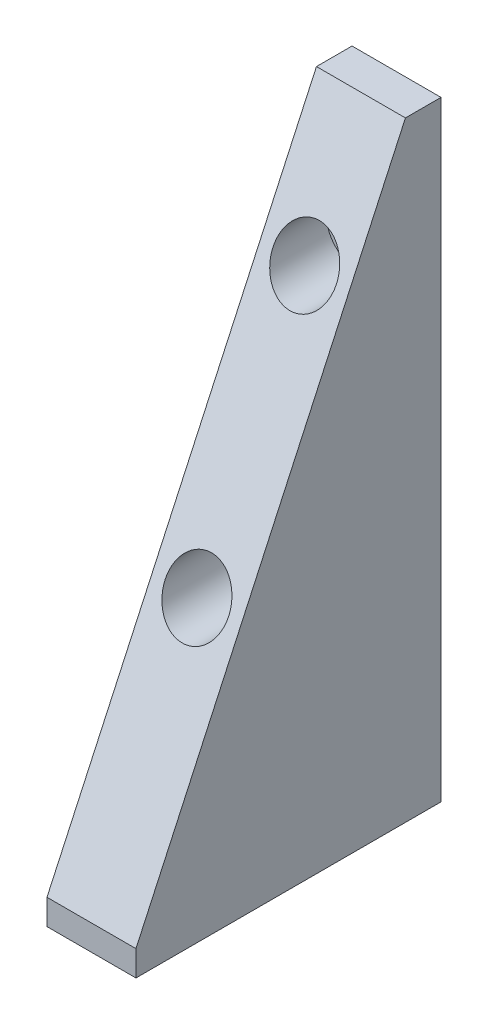
ISO-10303-21;
HEADER;
FILE_DESCRIPTION(('STEP AP214'),'2;1');
FILE_NAME('part.step','',(''),(''),'','','');
FILE_SCHEMA(('AUTOMOTIVE_DESIGN { 1 0 10303 214 1 1 1 1 }'));
ENDSEC;
DATA;
#1=APPLICATION_CONTEXT('core data for automotive mechanical design processes');
#2=APPLICATION_PROTOCOL_DEFINITION('international standard','automotive_design',2000,#1);
#3=PRODUCT_CONTEXT('',#1,'mechanical');
#4=PRODUCT('Part','Part','',(#3));
#5=PRODUCT_RELATED_PRODUCT_CATEGORY('part','',(#4));
#6=PRODUCT_DEFINITION_FORMATION('','',#4);
#7=PRODUCT_DEFINITION_CONTEXT('part definition',#1,'design');
#8=PRODUCT_DEFINITION('design','',#6,#7);
#9=PRODUCT_DEFINITION_SHAPE('','',#8);
#10=(LENGTH_UNIT() NAMED_UNIT(*) SI_UNIT(.MILLI.,.METRE.));
#11=(NAMED_UNIT(*) PLANE_ANGLE_UNIT() SI_UNIT($,.RADIAN.));
#12=(NAMED_UNIT(*) SI_UNIT($,.STERADIAN.) SOLID_ANGLE_UNIT());
#13=UNCERTAINTY_MEASURE_WITH_UNIT(LENGTH_MEASURE(1.E-05),#10,'distance_accuracy_value','');
#14=(GEOMETRIC_REPRESENTATION_CONTEXT(3) GLOBAL_UNCERTAINTY_ASSIGNED_CONTEXT((#13)) GLOBAL_UNIT_ASSIGNED_CONTEXT((#10,
#11,#12)) REPRESENTATION_CONTEXT('',''));
#15=CARTESIAN_POINT('',(0.,0.,0.));
#16=DIRECTION('',(0.,0.,1.));
#17=DIRECTION('',(1.,0.,0.));
#18=AXIS2_PLACEMENT_3D('',#15,#16,#17);
#19=CARTESIAN_POINT('',(22.225,-25.781,-30.4159761721431));
#20=DIRECTION('',(0.,0.,1.));
#21=DIRECTION('',(1.,0.,0.));
#22=AXIS2_PLACEMENT_3D('',#19,#20,#21);
#23=PLANE('',#22);
#24=CARTESIAN_POINT('',(11.1125,37.719,-30.4159761721431));
#25=DIRECTION('',(0.,0.,1.));
#26=DIRECTION('',(1.,0.,0.));
#27=AXIS2_PLACEMENT_3D('',#24,#25,#26);
#28=CIRCLE('',#27,4.90219999999999);
#29=CARTESIAN_POINT('',(16.0147,37.719,-30.4159761721431));
#30=VERTEX_POINT('',#29);
#31=EDGE_CURVE('E153',#30,#30,#28,.T.);
#32=ORIENTED_EDGE('',*,*,#31,.T.);
#33=EDGE_LOOP('',(#32));
#34=FACE_BOUND('',#33,.T.);
#35=CARTESIAN_POINT('',(11.1125,96.139,-30.4159761721431));
#36=DIRECTION('',(0.,0.,1.));
#37=DIRECTION('',(1.,0.,0.));
#38=AXIS2_PLACEMENT_3D('',#35,#36,#37);
#39=CIRCLE('',#38,4.90219999999999);
#40=CARTESIAN_POINT('',(16.0147,96.139,-30.4159761721431));
#41=VERTEX_POINT('',#40);
#42=EDGE_CURVE('E118',#41,#41,#39,.T.);
#43=ORIENTED_EDGE('',*,*,#42,.T.);
#44=EDGE_LOOP('',(#43));
#45=FACE_BOUND('',#44,.T.);
#46=DIRECTION('',(0.,1.,0.));
#47=VECTOR('',#46,1.);
#48=CARTESIAN_POINT('',(0.,-25.781,-30.4159761721431));
#49=LINE('',#48,#47);
#50=CARTESIAN_POINT('',(0.,-25.781,-30.4159761721431));
#51=VERTEX_POINT('',#50);
#52=CARTESIAN_POINT('',(0.,126.619,-30.4159761721431));
#53=VERTEX_POINT('',#52);
#54=EDGE_CURVE('E114',#51,#53,#49,.T.);
#55=ORIENTED_EDGE('',*,*,#54,.T.);
#56=DIRECTION('',(-1.,0.,0.));
#57=VECTOR('',#56,1.);
#58=CARTESIAN_POINT('',(22.225,126.619,-30.4159761721431));
#59=LINE('',#58,#57);
#60=CARTESIAN_POINT('',(22.225,126.619,-30.4159761721431));
#61=VERTEX_POINT('',#60);
#62=EDGE_CURVE('E11',#61,#53,#59,.T.);
#63=ORIENTED_EDGE('',*,*,#62,.F.);
#64=DIRECTION('',(0.,1.,0.));
#65=VECTOR('',#64,1.);
#66=CARTESIAN_POINT('',(22.225,-25.781,-30.4159761721431));
#67=LINE('',#66,#65);
#68=CARTESIAN_POINT('',(22.225,-25.781,-30.4159761721431));
#69=VERTEX_POINT('',#68);
#70=EDGE_CURVE('E123',#69,#61,#67,.T.);
#71=ORIENTED_EDGE('',*,*,#70,.F.);
#72=DIRECTION('',(-1.,0.,0.));
#73=VECTOR('',#72,1.);
#74=CARTESIAN_POINT('',(22.225,-25.781,-30.4159761721431));
#75=LINE('',#74,#73);
#76=EDGE_CURVE('E110',#69,#51,#75,.T.);
#77=ORIENTED_EDGE('',*,*,#76,.T.);
#78=EDGE_LOOP('',(#55,#63,#71,#77));
#79=FACE_BOUND('',#78,.T.);
#80=ADVANCED_FACE('F37',(#34,#45,#79),#23,.F.);
#81=CARTESIAN_POINT('',(22.225,126.619,-21.5259761721431));
#82=DIRECTION('',(0.,-1.,0.));
#83=DIRECTION('',(0.,0.,-1.));
#84=AXIS2_PLACEMENT_3D('',#81,#82,#83);
#85=PLANE('',#84);
#86=DIRECTION('',(0.,0.,1.));
#87=VECTOR('',#86,1.);
#88=CARTESIAN_POINT('',(0.,126.619,-21.5259761721431));
#89=LINE('',#88,#87);
#90=CARTESIAN_POINT('',(0.,126.619,-21.5259761721431));
#91=VERTEX_POINT('',#90);
#92=EDGE_CURVE('E117',#53,#91,#89,.T.);
#93=ORIENTED_EDGE('',*,*,#92,.T.);
#94=DIRECTION('',(-1.,0.,0.));
#95=VECTOR('',#94,1.);
#96=CARTESIAN_POINT('',(22.225,126.619,-21.5259761721431));
#97=LINE('',#96,#95);
#98=CARTESIAN_POINT('',(22.225,126.619,-21.5259761721431));
#99=VERTEX_POINT('',#98);
#100=EDGE_CURVE('E45',#99,#91,#97,.T.);
#101=ORIENTED_EDGE('',*,*,#100,.F.);
#102=DIRECTION('',(0.,0.,1.));
#103=VECTOR('',#102,1.);
#104=CARTESIAN_POINT('',(22.225,126.619,-21.5259761721431));
#105=LINE('',#104,#103);
#106=EDGE_CURVE('E88',#61,#99,#105,.T.);
#107=ORIENTED_EDGE('',*,*,#106,.F.);
#108=ORIENTED_EDGE('',*,*,#62,.T.);
#109=EDGE_LOOP('',(#93,#101,#107,#108));
#110=FACE_BOUND('',#109,.T.);
#111=ADVANCED_FACE('F145',(#110),#85,.F.);
#112=CARTESIAN_POINT('',(22.225,126.619,-21.5259761721431));
#113=DIRECTION('',(0.,-0.418557308836963,-0.90819038709907));
#114=DIRECTION('',(0.,0.908190387099071,-0.418557308836963));
#115=AXIS2_PLACEMENT_3D('',#112,#113,#114);
#116=PLANE('',#115);
#117=CARTESIAN_POINT('',(11.1125,96.139,-7.47867182431705));
#118=DIRECTION('',(0.,-0.418557308836963,-0.90819038709907));
#119=DIRECTION('',(0.,0.908190387099071,-0.418557308836963));
#120=AXIS2_PLACEMENT_3D('',#117,#118,#119);
#121=ELLIPSE('',#120,8.739907526828,7.9375);
#122=CARTESIAN_POINT('',(11.1125,104.0765,-11.1368239982301));
#123=VERTEX_POINT('',#122);
#124=EDGE_CURVE('E176',#123,#123,#121,.T.);
#125=ORIENTED_EDGE('',*,*,#124,.T.);
#126=EDGE_LOOP('',(#125));
#127=FACE_BOUND('',#126,.T.);
#128=CARTESIAN_POINT('',(11.1125,37.719,19.445328175683));
#129=DIRECTION('',(0.,-0.418557308836963,-0.90819038709907));
#130=DIRECTION('',(0.,0.908190387099071,-0.418557308836963));
#131=AXIS2_PLACEMENT_3D('',#128,#129,#130);
#132=ELLIPSE('',#131,8.739907526828,7.9375);
#133=CARTESIAN_POINT('',(11.1125,45.6565,15.7871760017699));
#134=VERTEX_POINT('',#133);
#135=EDGE_CURVE('E173',#134,#134,#132,.T.);
#136=ORIENTED_EDGE('',*,*,#135,.T.);
#137=EDGE_LOOP('',(#136));
#138=FACE_BOUND('',#137,.T.);
#139=DIRECTION('',(0.,-0.90819038709907,0.418557308836963));
#140=VECTOR('',#139,1.);
#141=CARTESIAN_POINT('',(0.,126.619,-21.5259761721431));
#142=LINE('',#141,#140);
#143=CARTESIAN_POINT('',(0.,-19.431,45.7840238278569));
#144=VERTEX_POINT('',#143);
#145=EDGE_CURVE('E105',#91,#144,#142,.T.);
#146=ORIENTED_EDGE('',*,*,#145,.T.);
#147=DIRECTION('',(-1.,0.,0.));
#148=VECTOR('',#147,1.);
#149=CARTESIAN_POINT('',(22.225,-19.431,45.7840238278569));
#150=LINE('',#149,#148);
#151=CARTESIAN_POINT('',(22.225,-19.431,45.7840238278569));
#152=VERTEX_POINT('',#151);
#153=EDGE_CURVE('E102',#152,#144,#150,.T.);
#154=ORIENTED_EDGE('',*,*,#153,.F.);
#155=DIRECTION('',(0.,-0.90819038709907,0.418557308836963));
#156=VECTOR('',#155,1.);
#157=CARTESIAN_POINT('',(22.225,126.619,-21.5259761721431));
#158=LINE('',#157,#156);
#159=EDGE_CURVE('E94',#99,#152,#158,.T.);
#160=ORIENTED_EDGE('',*,*,#159,.F.);
#161=ORIENTED_EDGE('',*,*,#100,.T.);
#162=EDGE_LOOP('',(#146,#154,#160,#161));
#163=FACE_BOUND('',#162,.T.);
#164=ADVANCED_FACE('F103',(#127,#138,#163),#116,.F.);
#165=CARTESIAN_POINT('',(22.225,-19.431,45.7840238278569));
#166=DIRECTION('',(0.,0.,-1.));
#167=DIRECTION('',(-1.,0.,0.));
#168=AXIS2_PLACEMENT_3D('',#165,#166,#167);
#169=PLANE('',#168);
#170=DIRECTION('',(0.,-1.,0.));
#171=VECTOR('',#170,1.);
#172=CARTESIAN_POINT('',(0.,-19.431,45.7840238278569));
#173=LINE('',#172,#171);
#174=CARTESIAN_POINT('',(0.,-25.781,45.7840238278569));
#175=VERTEX_POINT('',#174);
#176=EDGE_CURVE('E74',#144,#175,#173,.T.);
#177=ORIENTED_EDGE('',*,*,#176,.T.);
#178=DIRECTION('',(-1.,0.,0.));
#179=VECTOR('',#178,1.);
#180=CARTESIAN_POINT('',(22.225,-25.781,45.7840238278569));
#181=LINE('',#180,#179);
#182=CARTESIAN_POINT('',(22.225,-25.781,45.7840238278569));
#183=VERTEX_POINT('',#182);
#184=EDGE_CURVE('E106',#183,#175,#181,.T.);
#185=ORIENTED_EDGE('',*,*,#184,.F.);
#186=DIRECTION('',(0.,-1.,0.));
#187=VECTOR('',#186,1.);
#188=CARTESIAN_POINT('',(22.225,-19.431,45.7840238278569));
#189=LINE('',#188,#187);
#190=EDGE_CURVE('E98',#152,#183,#189,.T.);
#191=ORIENTED_EDGE('',*,*,#190,.F.);
#192=ORIENTED_EDGE('',*,*,#153,.T.);
#193=EDGE_LOOP('',(#177,#185,#191,#192));
#194=FACE_BOUND('',#193,.T.);
#195=ADVANCED_FACE('F108',(#194),#169,.F.);
#196=CARTESIAN_POINT('',(22.225,-25.781,45.7840238278569));
#197=DIRECTION('',(0.,1.,0.));
#198=DIRECTION('',(0.,0.,1.));
#199=AXIS2_PLACEMENT_3D('',#196,#197,#198);
#200=PLANE('',#199);
#201=CARTESIAN_POINT('',(11.1125,-25.781,-15.1759761721431));
#202=DIRECTION('',(0.,-1.,0.));
#203=DIRECTION('',(0.,0.,-1.));
#204=AXIS2_PLACEMENT_3D('',#201,#202,#203);
#205=CIRCLE('',#204,3.96875);
#206=CARTESIAN_POINT('',(11.1125,-25.781,-19.1447261721431));
#207=VERTEX_POINT('',#206);
#208=EDGE_CURVE('E188',#207,#207,#205,.T.);
#209=ORIENTED_EDGE('',*,*,#208,.F.);
#210=EDGE_LOOP('',(#209));
#211=FACE_BOUND('',#210,.T.);
#212=CARTESIAN_POINT('',(11.1125,-25.781,25.4640238278569));
#213=DIRECTION('',(0.,-1.,0.));
#214=DIRECTION('',(0.,0.,-1.));
#215=AXIS2_PLACEMENT_3D('',#212,#213,#214);
#216=CIRCLE('',#215,3.96875);
#217=CARTESIAN_POINT('',(11.1125,-25.781,21.4952738278569));
#218=VERTEX_POINT('',#217);
#219=EDGE_CURVE('E182',#218,#218,#216,.T.);
#220=ORIENTED_EDGE('',*,*,#219,.F.);
#221=EDGE_LOOP('',(#220));
#222=FACE_BOUND('',#221,.T.);
#223=DIRECTION('',(0.,0.,-1.));
#224=VECTOR('',#223,1.);
#225=CARTESIAN_POINT('',(0.,-25.781,45.7840238278569));
#226=LINE('',#225,#224);
#227=EDGE_CURVE('E80',#175,#51,#226,.T.);
#228=ORIENTED_EDGE('',*,*,#227,.T.);
#229=ORIENTED_EDGE('',*,*,#76,.F.);
#230=DIRECTION('',(0.,0.,-1.));
#231=VECTOR('',#230,1.);
#232=CARTESIAN_POINT('',(22.225,-25.781,45.7840238278569));
#233=LINE('',#232,#231);
#234=EDGE_CURVE('E53',#183,#69,#233,.T.);
#235=ORIENTED_EDGE('',*,*,#234,.F.);
#236=ORIENTED_EDGE('',*,*,#184,.T.);
#237=EDGE_LOOP('',(#228,#229,#235,#236));
#238=FACE_BOUND('',#237,.T.);
#239=ADVANCED_FACE('F131',(#211,#222,#238),#200,.F.);
#240=CARTESIAN_POINT('',(22.225,0.,0.));
#241=DIRECTION('',(-1.,0.,0.));
#242=DIRECTION('',(0.,0.,1.));
#243=AXIS2_PLACEMENT_3D('',#240,#241,#242);
#244=PLANE('',#243);
#245=ORIENTED_EDGE('',*,*,#70,.T.);
#246=ORIENTED_EDGE('',*,*,#106,.T.);
#247=ORIENTED_EDGE('',*,*,#159,.T.);
#248=ORIENTED_EDGE('',*,*,#190,.T.);
#249=ORIENTED_EDGE('',*,*,#234,.T.);
#250=EDGE_LOOP('',(#245,#246,#247,#248,#249));
#251=FACE_BOUND('',#250,.T.);
#252=ADVANCED_FACE('F96',(#251),#244,.F.);
#253=CARTESIAN_POINT('',(0.,0.,0.));
#254=DIRECTION('',(-1.,0.,0.));
#255=DIRECTION('',(0.,0.,1.));
#256=AXIS2_PLACEMENT_3D('',#253,#254,#255);
#257=PLANE('',#256);
#258=ORIENTED_EDGE('',*,*,#54,.F.);
#259=ORIENTED_EDGE('',*,*,#227,.F.);
#260=ORIENTED_EDGE('',*,*,#176,.F.);
#261=ORIENTED_EDGE('',*,*,#145,.F.);
#262=ORIENTED_EDGE('',*,*,#92,.F.);
#263=EDGE_LOOP('',(#258,#259,#260,#261,#262));
#264=FACE_BOUND('',#263,.T.);
#265=ADVANCED_FACE('F127',(#264),#257,.T.);
#266=CARTESIAN_POINT('',(11.1125,96.139,-11.3659761721431));
#267=DIRECTION('',(0.,0.,1.));
#268=DIRECTION('',(1.,0.,0.));
#269=AXIS2_PLACEMENT_3D('',#266,#267,#268);
#270=CYLINDRICAL_SURFACE('',#269,4.9022);
#271=ORIENTED_EDGE('',*,*,#42,.F.);
#272=EDGE_LOOP('',(#271));
#273=FACE_BOUND('',#272,.T.);
#274=CARTESIAN_POINT('',(11.1125,96.139,-20.8909761721431));
#275=DIRECTION('',(0.,0.,1.));
#276=DIRECTION('',(1.,0.,0.));
#277=AXIS2_PLACEMENT_3D('',#274,#275,#276);
#278=CIRCLE('',#277,4.9022);
#279=CARTESIAN_POINT('',(16.0147,96.139,-20.8909761721431));
#280=VERTEX_POINT('',#279);
#281=EDGE_CURVE('E157',#280,#280,#278,.T.);
#282=ORIENTED_EDGE('',*,*,#281,.T.);
#283=EDGE_LOOP('',(#282));
#284=FACE_BOUND('',#283,.T.);
#285=ADVANCED_FACE('F230',(#273,#284),#270,.F.);
#286=CARTESIAN_POINT('',(16.0147,96.139,-20.8909761721431));
#287=DIRECTION('',(0.,0.,-1.));
#288=DIRECTION('',(-1.,0.,0.));
#289=AXIS2_PLACEMENT_3D('',#286,#287,#288);
#290=PLANE('',#289);
#291=ORIENTED_EDGE('',*,*,#281,.F.);
#292=EDGE_LOOP('',(#291));
#293=FACE_BOUND('',#292,.T.);
#294=CARTESIAN_POINT('',(11.1125,96.139,-20.8909761721431));
#295=DIRECTION('',(0.,0.,1.));
#296=DIRECTION('',(1.,0.,0.));
#297=AXIS2_PLACEMENT_3D('',#294,#295,#296);
#298=CIRCLE('',#297,7.9375);
#299=CARTESIAN_POINT('',(19.05,96.139,-20.8909761721431));
#300=VERTEX_POINT('',#299);
#301=EDGE_CURVE('E160',#300,#300,#298,.T.);
#302=ORIENTED_EDGE('',*,*,#301,.T.);
#303=EDGE_LOOP('',(#302));
#304=FACE_BOUND('',#303,.T.);
#305=ADVANCED_FACE('F226',(#293,#304),#290,.F.);
#306=CARTESIAN_POINT('',(11.1125,96.139,-11.3659761721431));
#307=DIRECTION('',(0.,0.,1.));
#308=DIRECTION('',(1.,0.,0.));
#309=AXIS2_PLACEMENT_3D('',#306,#307,#308);
#310=CYLINDRICAL_SURFACE('',#309,7.9375);
#311=ORIENTED_EDGE('',*,*,#301,.F.);
#312=EDGE_LOOP('',(#311));
#313=FACE_BOUND('',#312,.T.);
#314=ORIENTED_EDGE('',*,*,#124,.F.);
#315=EDGE_LOOP('',(#314));
#316=FACE_BOUND('',#315,.T.);
#317=ADVANCED_FACE('F222',(#313,#316),#310,.F.);
#318=CARTESIAN_POINT('',(11.1125,37.719,-10.0959761721431));
#319=DIRECTION('',(0.,0.,1.));
#320=DIRECTION('',(1.,0.,0.));
#321=AXIS2_PLACEMENT_3D('',#318,#319,#320);
#322=CYLINDRICAL_SURFACE('',#321,4.9022);
#323=ORIENTED_EDGE('',*,*,#31,.F.);
#324=EDGE_LOOP('',(#323));
#325=FACE_BOUND('',#324,.T.);
#326=CARTESIAN_POINT('',(11.1125,37.719,-19.6209761721431));
#327=DIRECTION('',(0.,0.,1.));
#328=DIRECTION('',(1.,0.,0.));
#329=AXIS2_PLACEMENT_3D('',#326,#327,#328);
#330=CIRCLE('',#329,4.9022);
#331=CARTESIAN_POINT('',(16.0147,37.719,-19.6209761721431));
#332=VERTEX_POINT('',#331);
#333=EDGE_CURVE('E167',#332,#332,#330,.T.);
#334=ORIENTED_EDGE('',*,*,#333,.T.);
#335=EDGE_LOOP('',(#334));
#336=FACE_BOUND('',#335,.T.);
#337=ADVANCED_FACE('F218',(#325,#336),#322,.F.);
#338=CARTESIAN_POINT('',(16.0147,37.719,-19.6209761721431));
#339=DIRECTION('',(0.,0.,-1.));
#340=DIRECTION('',(-1.,0.,0.));
#341=AXIS2_PLACEMENT_3D('',#338,#339,#340);
#342=PLANE('',#341);
#343=ORIENTED_EDGE('',*,*,#333,.F.);
#344=EDGE_LOOP('',(#343));
#345=FACE_BOUND('',#344,.T.);
#346=CARTESIAN_POINT('',(11.1125,37.719,-19.6209761721431));
#347=DIRECTION('',(0.,0.,1.));
#348=DIRECTION('',(1.,0.,0.));
#349=AXIS2_PLACEMENT_3D('',#346,#347,#348);
#350=CIRCLE('',#349,7.9375);
#351=CARTESIAN_POINT('',(19.05,37.719,-19.6209761721431));
#352=VERTEX_POINT('',#351);
#353=EDGE_CURVE('E170',#352,#352,#350,.T.);
#354=ORIENTED_EDGE('',*,*,#353,.T.);
#355=EDGE_LOOP('',(#354));
#356=FACE_BOUND('',#355,.T.);
#357=ADVANCED_FACE('F214',(#345,#356),#342,.F.);
#358=CARTESIAN_POINT('',(11.1125,37.719,-10.0959761721431));
#359=DIRECTION('',(0.,0.,1.));
#360=DIRECTION('',(1.,0.,0.));
#361=AXIS2_PLACEMENT_3D('',#358,#359,#360);
#362=CYLINDRICAL_SURFACE('',#361,7.9375);
#363=ORIENTED_EDGE('',*,*,#353,.F.);
#364=EDGE_LOOP('',(#363));
#365=FACE_BOUND('',#364,.T.);
#366=ORIENTED_EDGE('',*,*,#135,.F.);
#367=EDGE_LOOP('',(#366));
#368=FACE_BOUND('',#367,.T.);
#369=ADVANCED_FACE('F210',(#365,#368),#362,.F.);
#370=CARTESIAN_POINT('',(11.1125,-0.38100000000001,25.4640238278569));
#371=DIRECTION('',(0.,-1.,0.));
#372=DIRECTION('',(0.,0.,-1.));
#373=AXIS2_PLACEMENT_3D('',#370,#371,#372);
#374=CONICAL_SURFACE('',#373,3.96874999999999,1.02974425867665);
#375=CARTESIAN_POINT('',(11.1125,2.00366558176562,25.4640238278569));
#376=VERTEX_POINT('',#375);
#377=VERTEX_LOOP('',#376);
#378=FACE_BOUND('',#377,.T.);
#379=CARTESIAN_POINT('',(11.1125,-0.38100000000001,25.4640238278569));
#380=DIRECTION('',(0.,-1.,0.));
#381=DIRECTION('',(0.,0.,-1.));
#382=AXIS2_PLACEMENT_3D('',#379,#380,#381);
#383=CIRCLE('',#382,3.96874999999999);
#384=CARTESIAN_POINT('',(11.1125,-0.38100000000001,21.4952738278569));
#385=VERTEX_POINT('',#384);
#386=EDGE_CURVE('E179',#385,#385,#383,.T.);
#387=ORIENTED_EDGE('',*,*,#386,.T.);
#388=EDGE_LOOP('',(#387));
#389=FACE_BOUND('',#388,.T.);
#390=ADVANCED_FACE('F206',(#378,#389),#374,.F.);
#391=CARTESIAN_POINT('',(11.1125,-25.781,25.4640238278569));
#392=DIRECTION('',(0.,-1.,0.));
#393=DIRECTION('',(0.,0.,-1.));
#394=AXIS2_PLACEMENT_3D('',#391,#392,#393);
#395=CYLINDRICAL_SURFACE('',#394,3.96875);
#396=ORIENTED_EDGE('',*,*,#386,.F.);
#397=EDGE_LOOP('',(#396));
#398=FACE_BOUND('',#397,.T.);
#399=ORIENTED_EDGE('',*,*,#219,.T.);
#400=EDGE_LOOP('',(#399));
#401=FACE_BOUND('',#400,.T.);
#402=ADVANCED_FACE('F199',(#398,#401),#395,.F.);
#403=CARTESIAN_POINT('',(11.1125,-0.38100000000001,-15.1759761721431));
#404=DIRECTION('',(0.,-1.,0.));
#405=DIRECTION('',(0.,0.,-1.));
#406=AXIS2_PLACEMENT_3D('',#403,#404,#405);
#407=CONICAL_SURFACE('',#406,3.96874999999999,1.02974425867665);
#408=CARTESIAN_POINT('',(11.1125,2.00366558176562,-15.1759761721431));
#409=VERTEX_POINT('',#408);
#410=VERTEX_LOOP('',#409);
#411=FACE_BOUND('',#410,.T.);
#412=CARTESIAN_POINT('',(11.1125,-0.38100000000001,-15.1759761721431));
#413=DIRECTION('',(0.,-1.,0.));
#414=DIRECTION('',(0.,0.,-1.));
#415=AXIS2_PLACEMENT_3D('',#412,#413,#414);
#416=CIRCLE('',#415,3.96874999999999);
#417=CARTESIAN_POINT('',(11.1125,-0.38100000000001,-19.1447261721431));
#418=VERTEX_POINT('',#417);
#419=EDGE_CURVE('E185',#418,#418,#416,.T.);
#420=ORIENTED_EDGE('',*,*,#419,.T.);
#421=EDGE_LOOP('',(#420));
#422=FACE_BOUND('',#421,.T.);
#423=ADVANCED_FACE('F193',(#411,#422),#407,.F.);
#424=CARTESIAN_POINT('',(11.1125,-25.781,-15.1759761721431));
#425=DIRECTION('',(0.,-1.,0.));
#426=DIRECTION('',(0.,0.,-1.));
#427=AXIS2_PLACEMENT_3D('',#424,#425,#426);
#428=CYLINDRICAL_SURFACE('',#427,3.96875);
#429=ORIENTED_EDGE('',*,*,#419,.F.);
#430=EDGE_LOOP('',(#429));
#431=FACE_BOUND('',#430,.T.);
#432=ORIENTED_EDGE('',*,*,#208,.T.);
#433=EDGE_LOOP('',(#432));
#434=FACE_BOUND('',#433,.T.);
#435=ADVANCED_FACE('F191',(#431,#434),#428,.F.);
#436=CLOSED_SHELL('',(#80,#111,#164,#195,#239,#252,#265,#285,#305,#317,#337,#357,#369,#390,#402,
#423,#435));
#437=MANIFOLD_SOLID_BREP('B2',#436);
#438=ADVANCED_BREP_SHAPE_REPRESENTATION('',(#18,#437),#14);
#439=SHAPE_DEFINITION_REPRESENTATION(#9,#438);
ENDSEC;
END-ISO-10303-21;
